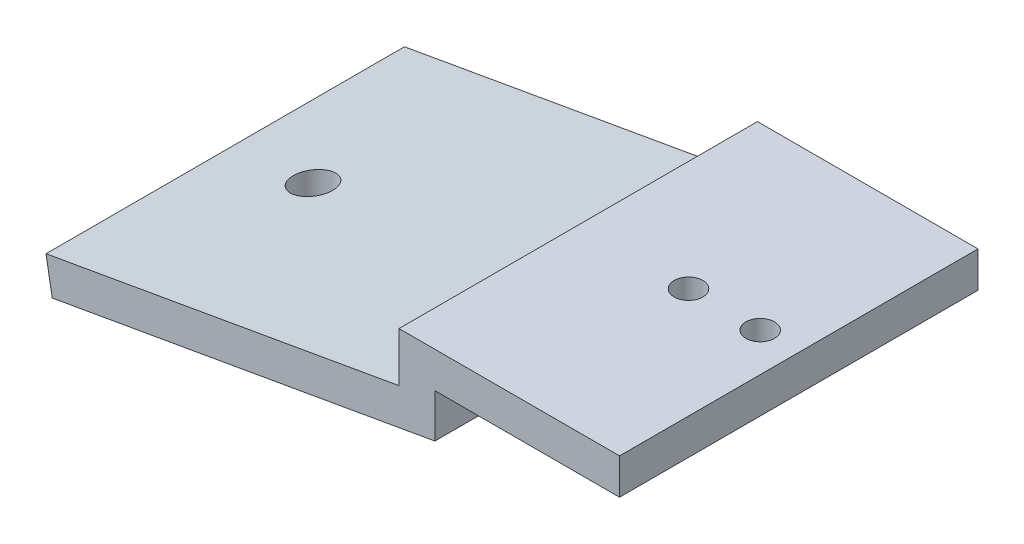
ISO-10303-21;
HEADER;
FILE_DESCRIPTION(('STEP AP214'),'2;1');
FILE_NAME('part.step','',(''),(''),'','','');
FILE_SCHEMA(('AUTOMOTIVE_DESIGN { 1 0 10303 214 1 1 1 1 }'));
ENDSEC;
DATA;
#1=APPLICATION_CONTEXT('core data for automotive mechanical design processes');
#2=APPLICATION_PROTOCOL_DEFINITION('international standard','automotive_design',2000,#1);
#3=PRODUCT_CONTEXT('',#1,'mechanical');
#4=PRODUCT('Part','Part','',(#3));
#5=PRODUCT_RELATED_PRODUCT_CATEGORY('part','',(#4));
#6=PRODUCT_DEFINITION_FORMATION('','',#4);
#7=PRODUCT_DEFINITION_CONTEXT('part definition',#1,'design');
#8=PRODUCT_DEFINITION('design','',#6,#7);
#9=PRODUCT_DEFINITION_SHAPE('','',#8);
#10=(LENGTH_UNIT() NAMED_UNIT(*) SI_UNIT(.MILLI.,.METRE.));
#11=(NAMED_UNIT(*) PLANE_ANGLE_UNIT() SI_UNIT($,.RADIAN.));
#12=(NAMED_UNIT(*) SI_UNIT($,.STERADIAN.) SOLID_ANGLE_UNIT());
#13=UNCERTAINTY_MEASURE_WITH_UNIT(LENGTH_MEASURE(1.E-05),#10,'distance_accuracy_value','');
#14=(GEOMETRIC_REPRESENTATION_CONTEXT(3) GLOBAL_UNCERTAINTY_ASSIGNED_CONTEXT((#13)) GLOBAL_UNIT_ASSIGNED_CONTEXT((#10,
#11,#12)) REPRESENTATION_CONTEXT('',''));
#15=CARTESIAN_POINT('',(0.,0.,0.));
#16=DIRECTION('',(0.,0.,1.));
#17=DIRECTION('',(1.,0.,0.));
#18=AXIS2_PLACEMENT_3D('',#15,#16,#17);
#19=CARTESIAN_POINT('',(0.,0.,50.));
#20=DIRECTION('',(1.,0.,0.));
#21=DIRECTION('',(0.,0.,-1.));
#22=AXIS2_PLACEMENT_3D('',#19,#20,#21);
#23=PLANE('',#22);
#24=DIRECTION('',(0.,-1.,0.));
#25=VECTOR('',#24,1.);
#26=CARTESIAN_POINT('',(0.,0.,0.));
#27=LINE('',#26,#25);
#28=CARTESIAN_POINT('',(0.,2.5,0.));
#29=VERTEX_POINT('',#28);
#30=CARTESIAN_POINT('',(0.,-2.5,0.));
#31=VERTEX_POINT('',#30);
#32=EDGE_CURVE('E130',#29,#31,#27,.T.);
#33=ORIENTED_EDGE('',*,*,#32,.F.);
#34=DIRECTION('',(0.,0.,-1.));
#35=VECTOR('',#34,1.);
#36=CARTESIAN_POINT('',(0.,2.5,50.));
#37=LINE('',#36,#35);
#38=CARTESIAN_POINT('',(0.,2.5,50.));
#39=VERTEX_POINT('',#38);
#40=EDGE_CURVE('E11',#39,#29,#37,.T.);
#41=ORIENTED_EDGE('',*,*,#40,.F.);
#42=DIRECTION('',(0.,-1.,0.));
#43=VECTOR('',#42,1.);
#44=CARTESIAN_POINT('',(0.,0.,50.));
#45=LINE('',#44,#43);
#46=CARTESIAN_POINT('',(0.,-2.5,50.));
#47=VERTEX_POINT('',#46);
#48=EDGE_CURVE('E148',#39,#47,#45,.T.);
#49=ORIENTED_EDGE('',*,*,#48,.T.);
#50=DIRECTION('',(0.,0.,-1.));
#51=VECTOR('',#50,1.);
#52=CARTESIAN_POINT('',(0.,-2.5,50.));
#53=LINE('',#52,#51);
#54=EDGE_CURVE('E53',#47,#31,#53,.T.);
#55=ORIENTED_EDGE('',*,*,#54,.T.);
#56=EDGE_LOOP('',(#33,#41,#49,#55));
#57=FACE_BOUND('',#56,.T.);
#58=ADVANCED_FACE('F35',(#57),#23,.T.);
#59=CARTESIAN_POINT('',(0.,2.5,50.));
#60=DIRECTION('',(0.,-1.,0.));
#61=DIRECTION('',(1.,0.,0.));
#62=AXIS2_PLACEMENT_3D('',#59,#60,#61);
#63=PLANE('',#62);
#64=CARTESIAN_POINT('',(-15.3798061746948,2.5,25.));
#65=DIRECTION('',(0.,1.,0.));
#66=DIRECTION('',(-1.,0.,0.));
#67=AXIS2_PLACEMENT_3D('',#64,#65,#66);
#68=CIRCLE('',#67,2.00000000000001);
#69=CARTESIAN_POINT('',(-17.3798061746948,2.5,25.));
#70=VERTEX_POINT('',#69);
#71=EDGE_CURVE('E164',#70,#70,#68,.T.);
#72=ORIENTED_EDGE('',*,*,#71,.F.);
#73=EDGE_LOOP('',(#72));
#74=FACE_BOUND('',#73,.T.);
#75=CARTESIAN_POINT('',(-5.37980617469478,2.5,25.));
#76=DIRECTION('',(0.,1.,0.));
#77=DIRECTION('',(-1.,0.,0.));
#78=AXIS2_PLACEMENT_3D('',#75,#76,#77);
#79=CIRCLE('',#78,2.);
#80=CARTESIAN_POINT('',(-7.37980617469478,2.5,25.));
#81=VERTEX_POINT('',#80);
#82=EDGE_CURVE('E169',#81,#81,#79,.T.);
#83=ORIENTED_EDGE('',*,*,#82,.F.);
#84=EDGE_LOOP('',(#83));
#85=FACE_BOUND('',#84,.T.);
#86=DIRECTION('',(-1.,0.,0.));
#87=VECTOR('',#86,1.);
#88=CARTESIAN_POINT('',(0.,2.5,0.));
#89=LINE('',#88,#87);
#90=CARTESIAN_POINT('',(-30.7596123493896,2.5,0.));
#91=VERTEX_POINT('',#90);
#92=EDGE_CURVE('E132',#29,#91,#89,.T.);
#93=ORIENTED_EDGE('',*,*,#92,.T.);
#94=DIRECTION('',(0.,0.,-1.));
#95=VECTOR('',#94,1.);
#96=CARTESIAN_POINT('',(-30.7596123493896,2.5,50.));
#97=LINE('',#96,#95);
#98=CARTESIAN_POINT('',(-30.7596123493896,2.5,50.));
#99=VERTEX_POINT('',#98);
#100=EDGE_CURVE('E44',#99,#91,#97,.T.);
#101=ORIENTED_EDGE('',*,*,#100,.F.);
#102=DIRECTION('',(-1.,0.,0.));
#103=VECTOR('',#102,1.);
#104=CARTESIAN_POINT('',(0.,2.5,50.));
#105=LINE('',#104,#103);
#106=EDGE_CURVE('E179',#39,#99,#105,.T.);
#107=ORIENTED_EDGE('',*,*,#106,.F.);
#108=ORIENTED_EDGE('',*,*,#40,.T.);
#109=EDGE_LOOP('',(#93,#101,#107,#108));
#110=FACE_BOUND('',#109,.T.);
#111=ADVANCED_FACE('F211',(#74,#85,#110),#63,.F.);
#112=CARTESIAN_POINT('',(-30.7596123493896,0.,50.));
#113=DIRECTION('',(1.,0.,0.));
#114=DIRECTION('',(0.,0.,-1.));
#115=AXIS2_PLACEMENT_3D('',#112,#113,#114);
#116=PLANE('',#115);
#117=DIRECTION('',(0.,-1.,0.));
#118=VECTOR('',#117,1.);
#119=CARTESIAN_POINT('',(-30.7596123493896,0.,0.));
#120=LINE('',#119,#118);
#121=CARTESIAN_POINT('',(-30.7596123493896,-4.39789089681127,0.));
#122=VERTEX_POINT('',#121);
#123=EDGE_CURVE('E135',#91,#122,#120,.T.);
#124=ORIENTED_EDGE('',*,*,#123,.T.);
#125=DIRECTION('',(0.,0.,-1.));
#126=VECTOR('',#125,1.);
#127=CARTESIAN_POINT('',(-30.7596123493896,-4.39789089681127,50.));
#128=LINE('',#127,#126);
#129=CARTESIAN_POINT('',(-30.7596123493896,-4.39789089681127,50.));
#130=VERTEX_POINT('',#129);
#131=EDGE_CURVE('E155',#130,#122,#128,.T.);
#132=ORIENTED_EDGE('',*,*,#131,.F.);
#133=DIRECTION('',(0.,-1.,0.));
#134=VECTOR('',#133,1.);
#135=CARTESIAN_POINT('',(-30.7596123493896,0.,50.));
#136=LINE('',#135,#134);
#137=EDGE_CURVE('E181',#99,#130,#136,.T.);
#138=ORIENTED_EDGE('',*,*,#137,.F.);
#139=ORIENTED_EDGE('',*,*,#100,.T.);
#140=EDGE_LOOP('',(#124,#132,#138,#139));
#141=FACE_BOUND('',#140,.T.);
#142=ADVANCED_FACE('F215',(#141),#116,.F.);
#143=CARTESIAN_POINT('',(-0.175432165787502,0.994925252406838,50.));
#144=DIRECTION('',(0.173648177666927,-0.984807753012209,0.));
#145=DIRECTION('',(0.984807753012209,0.173648177666927,0.));
#146=AXIS2_PLACEMENT_3D('',#143,#144,#145);
#147=PLANE('',#146);
#148=CARTESIAN_POINT('',(-67.7596123493896,-10.9219891830243,25.));
#149=DIRECTION('',(0.173648177666927,-0.984807753012209,0.));
#150=DIRECTION('',(0.984807753012209,0.173648177666927,0.));
#151=AXIS2_PLACEMENT_3D('',#148,#149,#150);
#152=ELLIPSE('',#151,2.79242318268581,2.75000000000001);
#153=CARTESIAN_POINT('',(-65.0096123493896,-10.4370899860761,25.));
#154=VERTEX_POINT('',#153);
#155=EDGE_CURVE('E133',#154,#154,#152,.T.);
#156=ORIENTED_EDGE('',*,*,#155,.T.);
#157=EDGE_LOOP('',(#156));
#158=FACE_BOUND('',#157,.T.);
#159=DIRECTION('',(-0.984807753012209,-0.173648177666927,0.));
#160=VECTOR('',#159,1.);
#161=CARTESIAN_POINT('',(-0.175432165787502,0.994925252406838,0.));
#162=LINE('',#161,#160);
#163=CARTESIAN_POINT('',(-80.,-13.0802997801576,0.));
#164=VERTEX_POINT('',#163);
#165=EDGE_CURVE('E137',#122,#164,#162,.T.);
#166=ORIENTED_EDGE('',*,*,#165,.T.);
#167=DIRECTION('',(0.,0.,-1.));
#168=VECTOR('',#167,1.);
#169=CARTESIAN_POINT('',(-80.,-13.0802997801576,50.));
#170=LINE('',#169,#168);
#171=CARTESIAN_POINT('',(-80.,-13.0802997801576,50.));
#172=VERTEX_POINT('',#171);
#173=EDGE_CURVE('E152',#172,#164,#170,.T.);
#174=ORIENTED_EDGE('',*,*,#173,.F.);
#175=DIRECTION('',(-0.984807753012209,-0.173648177666927,0.));
#176=VECTOR('',#175,1.);
#177=CARTESIAN_POINT('',(-0.175432165787502,0.994925252406838,50.));
#178=LINE('',#177,#176);
#179=EDGE_CURVE('E183',#130,#172,#178,.T.);
#180=ORIENTED_EDGE('',*,*,#179,.F.);
#181=ORIENTED_EDGE('',*,*,#131,.T.);
#182=EDGE_LOOP('',(#166,#174,#180,#181));
#183=FACE_BOUND('',#182,.T.);
#184=ADVANCED_FACE('F189',(#158,#183),#147,.F.);
#185=CARTESIAN_POINT('',(-79.8245678342126,-14.0752250325642,50.));
#186=DIRECTION('',(0.984807753012209,0.173648177666924,0.));
#187=DIRECTION('',(-0.173648177666924,0.984807753012209,0.));
#188=AXIS2_PLACEMENT_3D('',#185,#186,#187);
#189=PLANE('',#188);
#190=DIRECTION('',(0.173648177666924,-0.984807753012209,0.));
#191=VECTOR('',#190,1.);
#192=CARTESIAN_POINT('',(-79.8245678342126,-14.0752250325642,0.));
#193=LINE('',#192,#191);
#194=CARTESIAN_POINT('',(-79.1317591116654,-18.0043385452187,0.));
#195=VERTEX_POINT('',#194);
#196=EDGE_CURVE('E139',#164,#195,#193,.T.);
#197=ORIENTED_EDGE('',*,*,#196,.T.);
#198=DIRECTION('',(0.,0.,-1.));
#199=VECTOR('',#198,1.);
#200=CARTESIAN_POINT('',(-79.1317591116654,-18.0043385452187,50.));
#201=LINE('',#200,#199);
#202=CARTESIAN_POINT('',(-79.1317591116654,-18.0043385452187,50.));
#203=VERTEX_POINT('',#202);
#204=EDGE_CURVE('E112',#203,#195,#201,.T.);
#205=ORIENTED_EDGE('',*,*,#204,.F.);
#206=DIRECTION('',(0.173648177666924,-0.984807753012209,0.));
#207=VECTOR('',#206,1.);
#208=CARTESIAN_POINT('',(-79.8245678342126,-14.0752250325642,50.));
#209=LINE('',#208,#207);
#210=EDGE_CURVE('E121',#172,#203,#209,.T.);
#211=ORIENTED_EDGE('',*,*,#210,.F.);
#212=ORIENTED_EDGE('',*,*,#173,.T.);
#213=EDGE_LOOP('',(#197,#205,#211,#212));
#214=FACE_BOUND('',#213,.T.);
#215=ADVANCED_FACE('F193',(#214),#189,.F.);
#216=CARTESIAN_POINT('',(0.692808722547133,-3.92911351265421,50.));
#217=DIRECTION('',(0.173648177666927,-0.984807753012209,0.));
#218=DIRECTION('',(0.984807753012209,0.173648177666927,0.));
#219=AXIS2_PLACEMENT_3D('',#216,#217,#218);
#220=PLANE('',#219);
#221=CARTESIAN_POINT('',(-67.7596123493896,-15.9991222424531,25.));
#222=DIRECTION('',(0.173648177666927,-0.984807753012209,0.));
#223=DIRECTION('',(0.984807753012209,0.173648177666927,0.));
#224=AXIS2_PLACEMENT_3D('',#221,#222,#223);
#225=ELLIPSE('',#224,2.79242318268581,2.75000000000001);
#226=CARTESIAN_POINT('',(-65.0096123493896,-15.5142230455048,25.));
#227=VERTEX_POINT('',#226);
#228=EDGE_CURVE('E160',#227,#227,#225,.T.);
#229=ORIENTED_EDGE('',*,*,#228,.F.);
#230=EDGE_LOOP('',(#229));
#231=FACE_BOUND('',#230,.T.);
#232=DIRECTION('',(-0.984807753012209,-0.173648177666927,0.));
#233=VECTOR('',#232,1.);
#234=CARTESIAN_POINT('',(0.692808722547133,-3.92911351265421,0.));
#235=LINE('',#234,#233);
#236=CARTESIAN_POINT('',(-25.7596123493896,-8.59338905269768,0.));
#237=VERTEX_POINT('',#236);
#238=EDGE_CURVE('E108',#237,#195,#235,.T.);
#239=ORIENTED_EDGE('',*,*,#238,.F.);
#240=DIRECTION('',(0.,0.,-1.));
#241=VECTOR('',#240,1.);
#242=CARTESIAN_POINT('',(-25.7596123493896,-8.59338905269768,50.));
#243=LINE('',#242,#241);
#244=CARTESIAN_POINT('',(-25.7596123493896,-8.59338905269768,50.));
#245=VERTEX_POINT('',#244);
#246=EDGE_CURVE('E103',#245,#237,#243,.T.);
#247=ORIENTED_EDGE('',*,*,#246,.F.);
#248=DIRECTION('',(-0.984807753012209,-0.173648177666927,0.));
#249=VECTOR('',#248,1.);
#250=CARTESIAN_POINT('',(0.692808722547133,-3.92911351265421,50.));
#251=LINE('',#250,#249);
#252=EDGE_CURVE('E106',#245,#203,#251,.T.);
#253=ORIENTED_EDGE('',*,*,#252,.T.);
#254=ORIENTED_EDGE('',*,*,#204,.T.);
#255=EDGE_LOOP('',(#239,#247,#253,#254));
#256=FACE_BOUND('',#255,.T.);
#257=ADVANCED_FACE('F105',(#231,#256),#220,.T.);
#258=CARTESIAN_POINT('',(-25.7596123493896,0.,50.));
#259=DIRECTION('',(1.,0.,0.));
#260=DIRECTION('',(0.,0.,-1.));
#261=AXIS2_PLACEMENT_3D('',#258,#259,#260);
#262=PLANE('',#261);
#263=DIRECTION('',(0.,-1.,0.));
#264=VECTOR('',#263,1.);
#265=CARTESIAN_POINT('',(-25.7596123493896,0.,0.));
#266=LINE('',#265,#264);
#267=CARTESIAN_POINT('',(-25.7596123493896,-2.5,0.));
#268=VERTEX_POINT('',#267);
#269=EDGE_CURVE('E143',#268,#237,#266,.T.);
#270=ORIENTED_EDGE('',*,*,#269,.F.);
#271=DIRECTION('',(0.,0.,-1.));
#272=VECTOR('',#271,1.);
#273=CARTESIAN_POINT('',(-25.7596123493896,-2.5,50.));
#274=LINE('',#273,#272);
#275=CARTESIAN_POINT('',(-25.7596123493896,-2.5,50.));
#276=VERTEX_POINT('',#275);
#277=EDGE_CURVE('E78',#276,#268,#274,.T.);
#278=ORIENTED_EDGE('',*,*,#277,.F.);
#279=DIRECTION('',(0.,-1.,0.));
#280=VECTOR('',#279,1.);
#281=CARTESIAN_POINT('',(-25.7596123493896,0.,50.));
#282=LINE('',#281,#280);
#283=EDGE_CURVE('E119',#276,#245,#282,.T.);
#284=ORIENTED_EDGE('',*,*,#283,.T.);
#285=ORIENTED_EDGE('',*,*,#246,.T.);
#286=EDGE_LOOP('',(#270,#278,#284,#285));
#287=FACE_BOUND('',#286,.T.);
#288=ADVANCED_FACE('F124',(#287),#262,.T.);
#289=CARTESIAN_POINT('',(0.,-2.5,50.));
#290=DIRECTION('',(0.,-1.,0.));
#291=DIRECTION('',(1.,0.,0.));
#292=AXIS2_PLACEMENT_3D('',#289,#290,#291);
#293=PLANE('',#292);
#294=CARTESIAN_POINT('',(-15.3798061746948,-2.5,25.));
#295=DIRECTION('',(0.,-1.,0.));
#296=DIRECTION('',(1.,0.,0.));
#297=AXIS2_PLACEMENT_3D('',#294,#295,#296);
#298=CIRCLE('',#297,2.00000000000001);
#299=CARTESIAN_POINT('',(-13.3798061746948,-2.5,25.));
#300=VERTEX_POINT('',#299);
#301=EDGE_CURVE('E38',#300,#300,#298,.T.);
#302=ORIENTED_EDGE('',*,*,#301,.F.);
#303=EDGE_LOOP('',(#302));
#304=FACE_BOUND('',#303,.T.);
#305=CARTESIAN_POINT('',(-5.37980617469478,-2.5,25.));
#306=DIRECTION('',(0.,-1.,0.));
#307=DIRECTION('',(1.,0.,0.));
#308=AXIS2_PLACEMENT_3D('',#305,#306,#307);
#309=CIRCLE('',#308,2.);
#310=CARTESIAN_POINT('',(-3.37980617469478,-2.5,25.));
#311=VERTEX_POINT('',#310);
#312=EDGE_CURVE('E162',#311,#311,#309,.T.);
#313=ORIENTED_EDGE('',*,*,#312,.F.);
#314=EDGE_LOOP('',(#313));
#315=FACE_BOUND('',#314,.T.);
#316=DIRECTION('',(-1.,0.,0.));
#317=VECTOR('',#316,1.);
#318=CARTESIAN_POINT('',(0.,-2.5,0.));
#319=LINE('',#318,#317);
#320=EDGE_CURVE('E145',#31,#268,#319,.T.);
#321=ORIENTED_EDGE('',*,*,#320,.F.);
#322=ORIENTED_EDGE('',*,*,#54,.F.);
#323=DIRECTION('',(-1.,0.,0.));
#324=VECTOR('',#323,1.);
#325=CARTESIAN_POINT('',(0.,-2.5,50.));
#326=LINE('',#325,#324);
#327=EDGE_CURVE('E125',#47,#276,#326,.T.);
#328=ORIENTED_EDGE('',*,*,#327,.T.);
#329=ORIENTED_EDGE('',*,*,#277,.T.);
#330=EDGE_LOOP('',(#321,#322,#328,#329));
#331=FACE_BOUND('',#330,.T.);
#332=ADVANCED_FACE('F197',(#304,#315,#331),#293,.T.);
#333=CARTESIAN_POINT('',(0.,0.,50.));
#334=DIRECTION('',(0.,0.,1.));
#335=DIRECTION('',(1.,0.,0.));
#336=AXIS2_PLACEMENT_3D('',#333,#334,#335);
#337=PLANE('',#336);
#338=ORIENTED_EDGE('',*,*,#48,.F.);
#339=ORIENTED_EDGE('',*,*,#106,.T.);
#340=ORIENTED_EDGE('',*,*,#137,.T.);
#341=ORIENTED_EDGE('',*,*,#179,.T.);
#342=ORIENTED_EDGE('',*,*,#210,.T.);
#343=ORIENTED_EDGE('',*,*,#252,.F.);
#344=ORIENTED_EDGE('',*,*,#283,.F.);
#345=ORIENTED_EDGE('',*,*,#327,.F.);
#346=EDGE_LOOP('',(#338,#339,#340,#341,#342,#343,#344,#345));
#347=FACE_BOUND('',#346,.T.);
#348=ADVANCED_FACE('F117',(#347),#337,.T.);
#349=CARTESIAN_POINT('',(0.,0.,0.));
#350=DIRECTION('',(0.,0.,1.));
#351=DIRECTION('',(1.,0.,0.));
#352=AXIS2_PLACEMENT_3D('',#349,#350,#351);
#353=PLANE('',#352);
#354=ORIENTED_EDGE('',*,*,#32,.T.);
#355=ORIENTED_EDGE('',*,*,#320,.T.);
#356=ORIENTED_EDGE('',*,*,#269,.T.);
#357=ORIENTED_EDGE('',*,*,#238,.T.);
#358=ORIENTED_EDGE('',*,*,#196,.F.);
#359=ORIENTED_EDGE('',*,*,#165,.F.);
#360=ORIENTED_EDGE('',*,*,#123,.F.);
#361=ORIENTED_EDGE('',*,*,#92,.F.);
#362=EDGE_LOOP('',(#354,#355,#356,#357,#358,#359,#360,#361));
#363=FACE_BOUND('',#362,.T.);
#364=ADVANCED_FACE('F195',(#363),#353,.F.);
#365=CARTESIAN_POINT('',(-67.7596123493896,-47.5,25.));
#366=DIRECTION('',(0.,1.,0.));
#367=DIRECTION('',(-1.,0.,0.));
#368=AXIS2_PLACEMENT_3D('',#365,#366,#367);
#369=CYLINDRICAL_SURFACE('',#368,2.75000000000001);
#370=ORIENTED_EDGE('',*,*,#228,.T.);
#371=EDGE_LOOP('',(#370));
#372=FACE_BOUND('',#371,.T.);
#373=ORIENTED_EDGE('',*,*,#155,.F.);
#374=EDGE_LOOP('',(#373));
#375=FACE_BOUND('',#374,.T.);
#376=ADVANCED_FACE('F235',(#372,#375),#369,.F.);
#377=CARTESIAN_POINT('',(-5.37980617469477,-47.5,25.));
#378=DIRECTION('',(0.,1.,0.));
#379=DIRECTION('',(-1.,0.,0.));
#380=AXIS2_PLACEMENT_3D('',#377,#378,#379);
#381=CYLINDRICAL_SURFACE('',#380,2.);
#382=ORIENTED_EDGE('',*,*,#312,.T.);
#383=EDGE_LOOP('',(#382));
#384=FACE_BOUND('',#383,.T.);
#385=ORIENTED_EDGE('',*,*,#82,.T.);
#386=EDGE_LOOP('',(#385));
#387=FACE_BOUND('',#386,.T.);
#388=ADVANCED_FACE('F238',(#384,#387),#381,.F.);
#389=CARTESIAN_POINT('',(-15.3798061746948,-47.5,25.));
#390=DIRECTION('',(0.,1.,0.));
#391=DIRECTION('',(-1.,0.,0.));
#392=AXIS2_PLACEMENT_3D('',#389,#390,#391);
#393=CYLINDRICAL_SURFACE('',#392,2.00000000000001);
#394=ORIENTED_EDGE('',*,*,#301,.T.);
#395=EDGE_LOOP('',(#394));
#396=FACE_BOUND('',#395,.T.);
#397=ORIENTED_EDGE('',*,*,#71,.T.);
#398=EDGE_LOOP('',(#397));
#399=FACE_BOUND('',#398,.T.);
#400=ADVANCED_FACE('F245',(#396,#399),#393,.F.);
#401=CLOSED_SHELL('',(#58,#111,#142,#184,#215,#257,#288,#332,#348,#364,#376,#388,#400));
#402=MANIFOLD_SOLID_BREP('B2',#401);
#403=ADVANCED_BREP_SHAPE_REPRESENTATION('',(#18,#402),#14);
#404=SHAPE_DEFINITION_REPRESENTATION(#9,#403);
ENDSEC;
END-ISO-10303-21;
